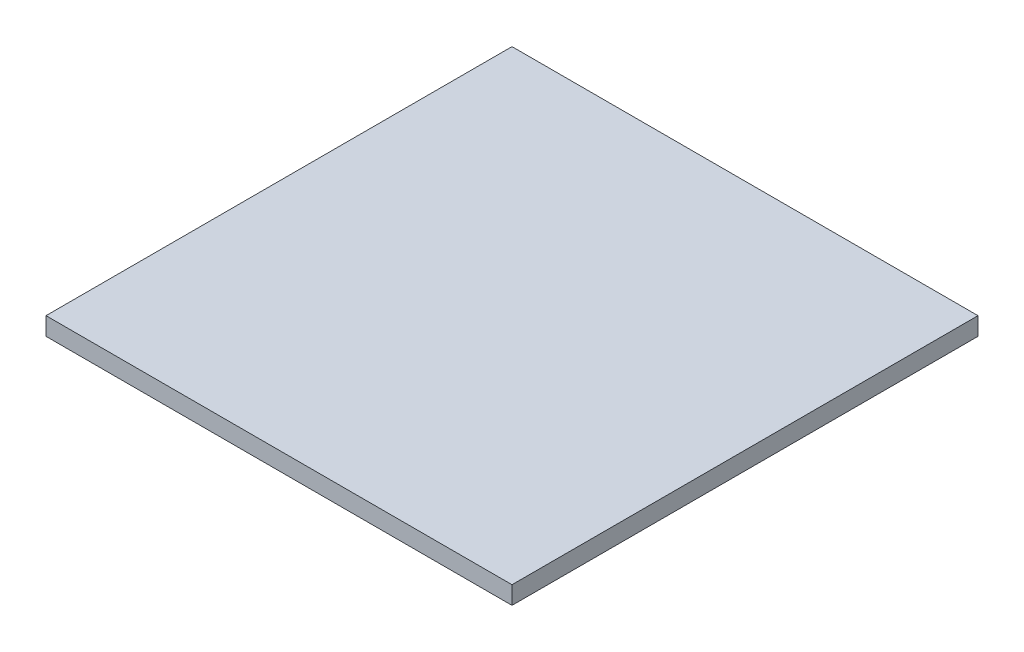
ISO-10303-21;
HEADER;
FILE_DESCRIPTION(('STEP AP214'),'2;1');
FILE_NAME('part.step','',(''),(''),'','','');
FILE_SCHEMA(('AUTOMOTIVE_DESIGN { 1 0 10303 214 1 1 1 1 }'));
ENDSEC;
DATA;
#1=APPLICATION_CONTEXT('core data for automotive mechanical design processes');
#2=APPLICATION_PROTOCOL_DEFINITION('international standard','automotive_design',2000,#1);
#3=PRODUCT_CONTEXT('',#1,'mechanical');
#4=PRODUCT('Part','Part','',(#3));
#5=PRODUCT_RELATED_PRODUCT_CATEGORY('part','',(#4));
#6=PRODUCT_DEFINITION_FORMATION('','',#4);
#7=PRODUCT_DEFINITION_CONTEXT('part definition',#1,'design');
#8=PRODUCT_DEFINITION('design','',#6,#7);
#9=PRODUCT_DEFINITION_SHAPE('','',#8);
#10=(LENGTH_UNIT() NAMED_UNIT(*) SI_UNIT(.MILLI.,.METRE.));
#11=(NAMED_UNIT(*) PLANE_ANGLE_UNIT() SI_UNIT($,.RADIAN.));
#12=(NAMED_UNIT(*) SI_UNIT($,.STERADIAN.) SOLID_ANGLE_UNIT());
#13=UNCERTAINTY_MEASURE_WITH_UNIT(LENGTH_MEASURE(1.E-05),#10,'distance_accuracy_value','');
#14=(GEOMETRIC_REPRESENTATION_CONTEXT(3) GLOBAL_UNCERTAINTY_ASSIGNED_CONTEXT((#13)) GLOBAL_UNIT_ASSIGNED_CONTEXT((#10,
#11,#12)) REPRESENTATION_CONTEXT('',''));
#15=CARTESIAN_POINT('',(0.,0.,0.));
#16=DIRECTION('',(0.,0.,1.));
#17=DIRECTION('',(1.,0.,0.));
#18=AXIS2_PLACEMENT_3D('',#15,#16,#17);
#19=CARTESIAN_POINT('',(-60.6547857142857,6.35,-121.567857142857));
#20=DIRECTION('',(1.,0.,0.));
#21=DIRECTION('',(0.,0.,-1.));
#22=AXIS2_PLACEMENT_3D('',#19,#20,#21);
#23=PLANE('',#22);
#24=DIRECTION('',(0.,0.,1.));
#25=VECTOR('',#24,1.);
#26=CARTESIAN_POINT('',(-60.6547857142857,0.,-121.567857142857));
#27=LINE('',#26,#25);
#28=CARTESIAN_POINT('',(-60.6547857142857,0.,-121.567857142857));
#29=VERTEX_POINT('',#28);
#30=CARTESIAN_POINT('',(-60.6547857142857,0.,43.5321428571429));
#31=VERTEX_POINT('',#30);
#32=EDGE_CURVE('E107',#29,#31,#27,.T.);
#33=ORIENTED_EDGE('',*,*,#32,.T.);
#34=DIRECTION('',(0.,-1.,0.));
#35=VECTOR('',#34,1.);
#36=CARTESIAN_POINT('',(-60.6547857142857,6.35,43.5321428571429));
#37=LINE('',#36,#35);
#38=CARTESIAN_POINT('',(-60.6547857142857,6.35,43.5321428571429));
#39=VERTEX_POINT('',#38);
#40=EDGE_CURVE('E11',#39,#31,#37,.T.);
#41=ORIENTED_EDGE('',*,*,#40,.F.);
#42=DIRECTION('',(0.,0.,1.));
#43=VECTOR('',#42,1.);
#44=CARTESIAN_POINT('',(-60.6547857142857,6.35,-121.567857142857));
#45=LINE('',#44,#43);
#46=CARTESIAN_POINT('',(-60.6547857142857,6.35,-121.567857142857));
#47=VERTEX_POINT('',#46);
#48=EDGE_CURVE('E91',#47,#39,#45,.T.);
#49=ORIENTED_EDGE('',*,*,#48,.F.);
#50=DIRECTION('',(0.,-1.,0.));
#51=VECTOR('',#50,1.);
#52=CARTESIAN_POINT('',(-60.6547857142857,6.35,-121.567857142857));
#53=LINE('',#52,#51);
#54=EDGE_CURVE('E103',#47,#29,#53,.T.);
#55=ORIENTED_EDGE('',*,*,#54,.T.);
#56=EDGE_LOOP('',(#33,#41,#49,#55));
#57=FACE_BOUND('',#56,.T.);
#58=ADVANCED_FACE('F39',(#57),#23,.F.);
#59=CARTESIAN_POINT('',(-60.6547857142857,6.35,43.5321428571429));
#60=DIRECTION('',(0.,0.,-1.));
#61=DIRECTION('',(-1.,0.,0.));
#62=AXIS2_PLACEMENT_3D('',#59,#60,#61);
#63=PLANE('',#62);
#64=DIRECTION('',(1.,0.,0.));
#65=VECTOR('',#64,1.);
#66=CARTESIAN_POINT('',(-60.6547857142857,0.,43.5321428571429));
#67=LINE('',#66,#65);
#68=CARTESIAN_POINT('',(104.445214285714,0.,43.5321428571429));
#69=VERTEX_POINT('',#68);
#70=EDGE_CURVE('E96',#31,#69,#67,.T.);
#71=ORIENTED_EDGE('',*,*,#70,.T.);
#72=DIRECTION('',(0.,-1.,0.));
#73=VECTOR('',#72,1.);
#74=CARTESIAN_POINT('',(104.445214285714,6.35,43.5321428571429));
#75=LINE('',#74,#73);
#76=CARTESIAN_POINT('',(104.445214285714,6.35,43.5321428571429));
#77=VERTEX_POINT('',#76);
#78=EDGE_CURVE('E48',#77,#69,#75,.T.);
#79=ORIENTED_EDGE('',*,*,#78,.F.);
#80=DIRECTION('',(1.,0.,0.));
#81=VECTOR('',#80,1.);
#82=CARTESIAN_POINT('',(-60.6547857142857,6.35,43.5321428571429));
#83=LINE('',#82,#81);
#84=EDGE_CURVE('E86',#39,#77,#83,.T.);
#85=ORIENTED_EDGE('',*,*,#84,.F.);
#86=ORIENTED_EDGE('',*,*,#40,.T.);
#87=EDGE_LOOP('',(#71,#79,#85,#86));
#88=FACE_BOUND('',#87,.T.);
#89=ADVANCED_FACE('F95',(#88),#63,.F.);
#90=CARTESIAN_POINT('',(104.445214285714,6.35,-121.567857142857));
#91=DIRECTION('',(-1.,0.,0.));
#92=DIRECTION('',(0.,0.,1.));
#93=AXIS2_PLACEMENT_3D('',#90,#91,#92);
#94=PLANE('',#93);
#95=DIRECTION('',(0.,0.,-1.));
#96=VECTOR('',#95,1.);
#97=CARTESIAN_POINT('',(104.445214285714,0.,-121.567857142857));
#98=LINE('',#97,#96);
#99=CARTESIAN_POINT('',(104.445214285714,0.,-121.567857142857));
#100=VERTEX_POINT('',#99);
#101=EDGE_CURVE('E73',#69,#100,#98,.T.);
#102=ORIENTED_EDGE('',*,*,#101,.T.);
#103=DIRECTION('',(0.,-1.,0.));
#104=VECTOR('',#103,1.);
#105=CARTESIAN_POINT('',(104.445214285714,6.35,-121.567857142857));
#106=LINE('',#105,#104);
#107=CARTESIAN_POINT('',(104.445214285714,6.35,-121.567857142857));
#108=VERTEX_POINT('',#107);
#109=EDGE_CURVE('E98',#108,#100,#106,.T.);
#110=ORIENTED_EDGE('',*,*,#109,.F.);
#111=DIRECTION('',(0.,0.,-1.));
#112=VECTOR('',#111,1.);
#113=CARTESIAN_POINT('',(104.445214285714,6.35,-121.567857142857));
#114=LINE('',#113,#112);
#115=EDGE_CURVE('E89',#77,#108,#114,.T.);
#116=ORIENTED_EDGE('',*,*,#115,.F.);
#117=ORIENTED_EDGE('',*,*,#78,.T.);
#118=EDGE_LOOP('',(#102,#110,#116,#117));
#119=FACE_BOUND('',#118,.T.);
#120=ADVANCED_FACE('F99',(#119),#94,.F.);
#121=CARTESIAN_POINT('',(-60.6547857142857,6.35,-121.567857142857));
#122=DIRECTION('',(0.,0.,1.));
#123=DIRECTION('',(1.,0.,0.));
#124=AXIS2_PLACEMENT_3D('',#121,#122,#123);
#125=PLANE('',#124);
#126=DIRECTION('',(-1.,0.,0.));
#127=VECTOR('',#126,1.);
#128=CARTESIAN_POINT('',(-60.6547857142857,0.,-121.567857142857));
#129=LINE('',#128,#127);
#130=EDGE_CURVE('E79',#100,#29,#129,.T.);
#131=ORIENTED_EDGE('',*,*,#130,.T.);
#132=ORIENTED_EDGE('',*,*,#54,.F.);
#133=DIRECTION('',(-1.,0.,0.));
#134=VECTOR('',#133,1.);
#135=CARTESIAN_POINT('',(-60.6547857142857,6.35,-121.567857142857));
#136=LINE('',#135,#134);
#137=EDGE_CURVE('E56',#108,#47,#136,.T.);
#138=ORIENTED_EDGE('',*,*,#137,.F.);
#139=ORIENTED_EDGE('',*,*,#109,.T.);
#140=EDGE_LOOP('',(#131,#132,#138,#139));
#141=FACE_BOUND('',#140,.T.);
#142=ADVANCED_FACE('F120',(#141),#125,.F.);
#143=CARTESIAN_POINT('',(0.,6.35,0.));
#144=DIRECTION('',(0.,1.,0.));
#145=DIRECTION('',(0.,0.,1.));
#146=AXIS2_PLACEMENT_3D('',#143,#144,#145);
#147=PLANE('',#146);
#148=ORIENTED_EDGE('',*,*,#48,.T.);
#149=ORIENTED_EDGE('',*,*,#84,.T.);
#150=ORIENTED_EDGE('',*,*,#115,.T.);
#151=ORIENTED_EDGE('',*,*,#137,.T.);
#152=EDGE_LOOP('',(#148,#149,#150,#151));
#153=FACE_BOUND('',#152,.T.);
#154=ADVANCED_FACE('F87',(#153),#147,.T.);
#155=CARTESIAN_POINT('',(0.,0.,0.));
#156=DIRECTION('',(0.,1.,0.));
#157=DIRECTION('',(0.,0.,1.));
#158=AXIS2_PLACEMENT_3D('',#155,#156,#157);
#159=PLANE('',#158);
#160=ORIENTED_EDGE('',*,*,#32,.F.);
#161=ORIENTED_EDGE('',*,*,#130,.F.);
#162=ORIENTED_EDGE('',*,*,#101,.F.);
#163=ORIENTED_EDGE('',*,*,#70,.F.);
#164=EDGE_LOOP('',(#160,#161,#162,#163));
#165=FACE_BOUND('',#164,.T.);
#166=ADVANCED_FACE('F123',(#165),#159,.F.);
#167=CLOSED_SHELL('',(#58,#89,#120,#142,#154,#166));
#168=MANIFOLD_SOLID_BREP('B2',#167);
#169=ADVANCED_BREP_SHAPE_REPRESENTATION('',(#18,#168),#14);
#170=SHAPE_DEFINITION_REPRESENTATION(#9,#169);
ENDSEC;
END-ISO-10303-21;
